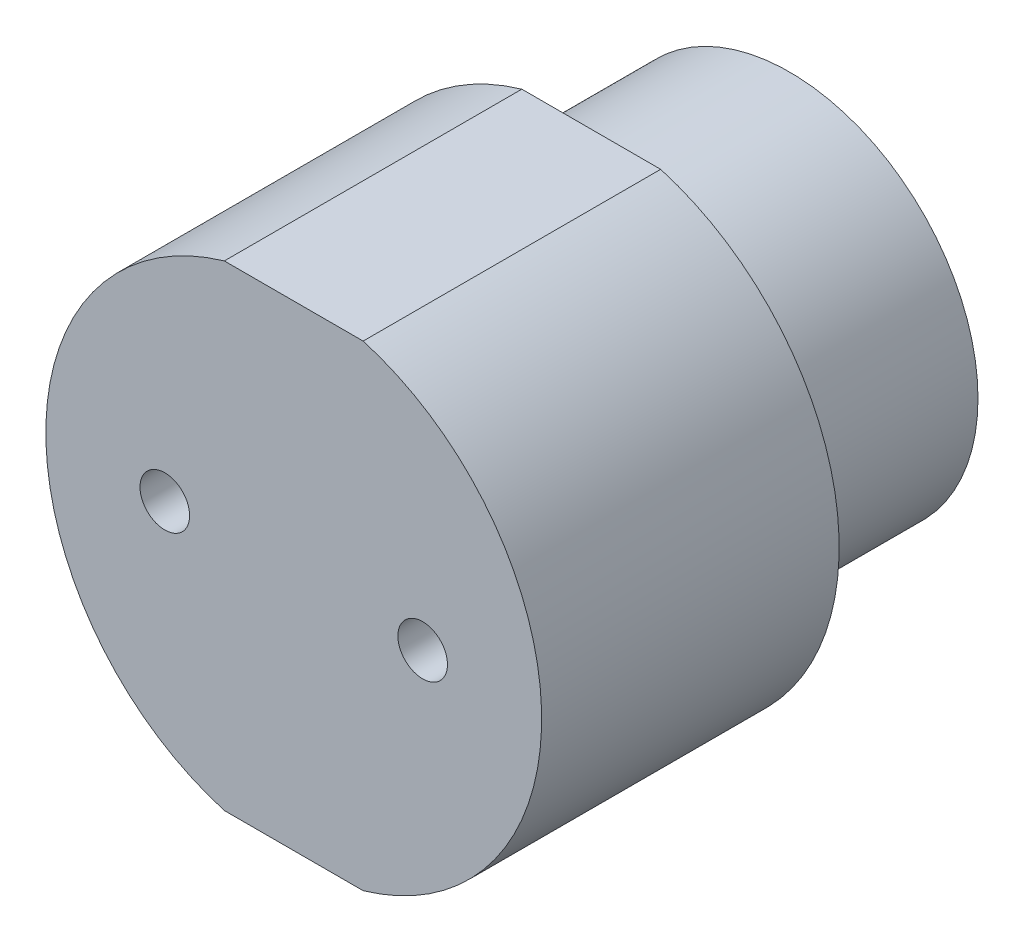
ISO-10303-21;
HEADER;
FILE_DESCRIPTION(('STEP AP214'),'2;1');
FILE_NAME('part.step','',(''),(''),'','','');
FILE_SCHEMA(('AUTOMOTIVE_DESIGN { 1 0 10303 214 1 1 1 1 }'));
ENDSEC;
DATA;
#1=APPLICATION_CONTEXT('core data for automotive mechanical design processes');
#2=APPLICATION_PROTOCOL_DEFINITION('international standard','automotive_design',2000,#1);
#3=PRODUCT_CONTEXT('',#1,'mechanical');
#4=PRODUCT('Part','Part','',(#3));
#5=PRODUCT_RELATED_PRODUCT_CATEGORY('part','',(#4));
#6=PRODUCT_DEFINITION_FORMATION('','',#4);
#7=PRODUCT_DEFINITION_CONTEXT('part definition',#1,'design');
#8=PRODUCT_DEFINITION('design','',#6,#7);
#9=PRODUCT_DEFINITION_SHAPE('','',#8);
#10=(LENGTH_UNIT() NAMED_UNIT(*) SI_UNIT(.MILLI.,.METRE.));
#11=(NAMED_UNIT(*) PLANE_ANGLE_UNIT() SI_UNIT($,.RADIAN.));
#12=(NAMED_UNIT(*) SI_UNIT($,.STERADIAN.) SOLID_ANGLE_UNIT());
#13=UNCERTAINTY_MEASURE_WITH_UNIT(LENGTH_MEASURE(1.E-05),#10,'distance_accuracy_value','');
#14=(GEOMETRIC_REPRESENTATION_CONTEXT(3) GLOBAL_UNCERTAINTY_ASSIGNED_CONTEXT((#13)) GLOBAL_UNIT_ASSIGNED_CONTEXT((#10,
#11,#12)) REPRESENTATION_CONTEXT('',''));
#15=CARTESIAN_POINT('',(0.,0.,0.));
#16=DIRECTION('',(0.,0.,1.));
#17=DIRECTION('',(1.,0.,0.));
#18=AXIS2_PLACEMENT_3D('',#15,#16,#17);
#19=CARTESIAN_POINT('',(0.,0.,0.));
#20=DIRECTION('',(0.,0.,1.));
#21=DIRECTION('',(1.,0.,0.));
#22=AXIS2_PLACEMENT_3D('',#19,#20,#21);
#23=CYLINDRICAL_SURFACE('',#22,63.5);
#24=DIRECTION('',(0.,0.,1.));
#25=VECTOR('',#24,1.);
#26=CARTESIAN_POINT('',(17.78,60.96,0.));
#27=LINE('',#26,#25);
#28=CARTESIAN_POINT('',(17.78,60.96,0.));
#29=VERTEX_POINT('',#28);
#30=CARTESIAN_POINT('',(17.78,60.96,-76.2));
#31=VERTEX_POINT('',#30);
#32=EDGE_CURVE('E69',#29,#31,#27,.F.);
#33=ORIENTED_EDGE('',*,*,#32,.F.);
#34=CARTESIAN_POINT('',(0.,0.,0.));
#35=DIRECTION('',(0.,0.,1.));
#36=DIRECTION('',(1.,0.,0.));
#37=AXIS2_PLACEMENT_3D('',#34,#35,#36);
#38=CIRCLE('',#37,63.5);
#39=CARTESIAN_POINT('',(17.78,-60.96,0.));
#40=VERTEX_POINT('',#39);
#41=EDGE_CURVE('E102',#40,#29,#38,.T.);
#42=ORIENTED_EDGE('',*,*,#41,.F.);
#43=DIRECTION('',(0.,0.,1.));
#44=VECTOR('',#43,1.);
#45=CARTESIAN_POINT('',(17.78,-60.96,0.));
#46=LINE('',#45,#44);
#47=CARTESIAN_POINT('',(17.78,-60.96,-76.2));
#48=VERTEX_POINT('',#47);
#49=EDGE_CURVE('E85',#48,#40,#46,.T.);
#50=ORIENTED_EDGE('',*,*,#49,.F.);
#51=CARTESIAN_POINT('',(0.,0.,-76.2));
#52=DIRECTION('',(0.,0.,1.));
#53=DIRECTION('',(1.,0.,0.));
#54=AXIS2_PLACEMENT_3D('',#51,#52,#53);
#55=CIRCLE('',#54,63.5);
#56=EDGE_CURVE('E114',#48,#31,#55,.T.);
#57=ORIENTED_EDGE('',*,*,#56,.T.);
#58=EDGE_LOOP('',(#33,#42,#50,#57));
#59=FACE_BOUND('',#58,.T.);
#60=ADVANCED_FACE('F45',(#59),#23,.T.);
#61=CARTESIAN_POINT('',(0.,0.,0.));
#62=DIRECTION('',(0.,0.,1.));
#63=DIRECTION('',(1.,0.,0.));
#64=AXIS2_PLACEMENT_3D('',#61,#62,#63);
#65=PLANE('',#64);
#66=DIRECTION('',(1.,0.,0.));
#67=VECTOR('',#66,1.);
#68=CARTESIAN_POINT('',(-21.59,60.96,0.));
#69=LINE('',#68,#67);
#70=CARTESIAN_POINT('',(-17.78,60.96,0.));
#71=VERTEX_POINT('',#70);
#72=EDGE_CURVE('E94',#71,#29,#69,.T.);
#73=ORIENTED_EDGE('',*,*,#72,.F.);
#74=CARTESIAN_POINT('',(-17.78,-60.96,0.));
#75=VERTEX_POINT('',#74);
#76=EDGE_CURVE('E104',#71,#75,#38,.T.);
#77=ORIENTED_EDGE('',*,*,#76,.T.);
#78=DIRECTION('',(-1.,0.,0.));
#79=VECTOR('',#78,1.);
#80=CARTESIAN_POINT('',(-21.59,-60.96,0.));
#81=LINE('',#80,#79);
#82=EDGE_CURVE('E88',#40,#75,#81,.T.);
#83=ORIENTED_EDGE('',*,*,#82,.F.);
#84=ORIENTED_EDGE('',*,*,#41,.T.);
#85=EDGE_LOOP('',(#73,#77,#83,#84));
#86=FACE_BOUND('',#85,.T.);
#87=CARTESIAN_POINT('',(-33.02,0.,0.));
#88=DIRECTION('',(0.,0.,1.));
#89=DIRECTION('',(1.,0.,0.));
#90=AXIS2_PLACEMENT_3D('',#87,#88,#89);
#91=CIRCLE('',#90,6.35);
#92=CARTESIAN_POINT('',(-26.67,0.,0.));
#93=VERTEX_POINT('',#92);
#94=EDGE_CURVE('E143',#93,#93,#91,.F.);
#95=ORIENTED_EDGE('',*,*,#94,.T.);
#96=EDGE_LOOP('',(#95));
#97=FACE_BOUND('',#96,.T.);
#98=CARTESIAN_POINT('',(33.02,0.,0.));
#99=DIRECTION('',(0.,0.,1.));
#100=DIRECTION('',(1.,0.,0.));
#101=AXIS2_PLACEMENT_3D('',#98,#99,#100);
#102=CIRCLE('',#101,6.35);
#103=CARTESIAN_POINT('',(39.37,0.,0.));
#104=VERTEX_POINT('',#103);
#105=EDGE_CURVE('E148',#104,#104,#102,.F.);
#106=ORIENTED_EDGE('',*,*,#105,.T.);
#107=EDGE_LOOP('',(#106));
#108=FACE_BOUND('',#107,.T.);
#109=ADVANCED_FACE('F100',(#86,#97,#108),#65,.T.);
#110=DIRECTION('',(0.,0.,1.));
#111=VECTOR('',#110,1.);
#112=CARTESIAN_POINT('',(-17.78,60.96,0.));
#113=LINE('',#112,#111);
#114=CARTESIAN_POINT('',(-17.78,60.96,-76.2));
#115=VERTEX_POINT('',#114);
#116=EDGE_CURVE('E348',#115,#71,#113,.T.);
#117=ORIENTED_EDGE('',*,*,#116,.F.);
#118=CARTESIAN_POINT('',(-17.78,-60.96,-76.2));
#119=VERTEX_POINT('',#118);
#120=EDGE_CURVE('E108',#115,#119,#55,.T.);
#121=ORIENTED_EDGE('',*,*,#120,.T.);
#122=DIRECTION('',(0.,0.,1.));
#123=VECTOR('',#122,1.);
#124=CARTESIAN_POINT('',(-17.78,-60.96,0.));
#125=LINE('',#124,#123);
#126=EDGE_CURVE('E62',#75,#119,#125,.F.);
#127=ORIENTED_EDGE('',*,*,#126,.F.);
#128=ORIENTED_EDGE('',*,*,#76,.F.);
#129=EDGE_LOOP('',(#117,#121,#127,#128));
#130=FACE_BOUND('',#129,.T.);
#131=ADVANCED_FACE('F182',(#130),#23,.T.);
#132=CARTESIAN_POINT('',(63.5,0.,-76.2));
#133=DIRECTION('',(0.,0.,-1.));
#134=DIRECTION('',(-1.,0.,0.));
#135=AXIS2_PLACEMENT_3D('',#132,#133,#134);
#136=PLANE('',#135);
#137=DIRECTION('',(-1.,0.,0.));
#138=VECTOR('',#137,1.);
#139=CARTESIAN_POINT('',(63.5,60.96,-76.2));
#140=LINE('',#139,#138);
#141=EDGE_CURVE('E12',#31,#115,#140,.T.);
#142=ORIENTED_EDGE('',*,*,#141,.F.);
#143=ORIENTED_EDGE('',*,*,#56,.F.);
#144=DIRECTION('',(1.,0.,0.));
#145=VECTOR('',#144,1.);
#146=CARTESIAN_POINT('',(63.5,-60.96,-76.2));
#147=LINE('',#146,#145);
#148=EDGE_CURVE('E55',#119,#48,#147,.T.);
#149=ORIENTED_EDGE('',*,*,#148,.F.);
#150=ORIENTED_EDGE('',*,*,#120,.F.);
#151=EDGE_LOOP('',(#142,#143,#149,#150));
#152=FACE_BOUND('',#151,.T.);
#153=CARTESIAN_POINT('',(0.,0.,-76.2));
#154=DIRECTION('',(0.,0.,-1.));
#155=DIRECTION('',(-1.,0.,0.));
#156=AXIS2_PLACEMENT_3D('',#153,#154,#155);
#157=CIRCLE('',#156,53.34);
#158=CARTESIAN_POINT('',(-53.34,0.,-76.2));
#159=VERTEX_POINT('',#158);
#160=EDGE_CURVE('E162',#159,#159,#157,.F.);
#161=ORIENTED_EDGE('',*,*,#160,.T.);
#162=EDGE_LOOP('',(#161));
#163=FACE_BOUND('',#162,.T.);
#164=ADVANCED_FACE('F180',(#152,#163),#136,.T.);
#165=CARTESIAN_POINT('',(0.,0.,0.));
#166=DIRECTION('',(0.,0.,1.));
#167=DIRECTION('',(1.,0.,0.));
#168=AXIS2_PLACEMENT_3D('',#165,#166,#167);
#169=CYLINDRICAL_SURFACE('',#168,48.26);
#170=CARTESIAN_POINT('',(0.,0.,-81.28));
#171=DIRECTION('',(0.,0.,-1.));
#172=DIRECTION('',(-1.,0.,0.));
#173=AXIS2_PLACEMENT_3D('',#170,#171,#172);
#174=CIRCLE('',#173,48.26);
#175=CARTESIAN_POINT('',(-48.26,0.,-81.28));
#176=VERTEX_POINT('',#175);
#177=EDGE_CURVE('E166',#176,#176,#174,.T.);
#178=ORIENTED_EDGE('',*,*,#177,.T.);
#179=EDGE_LOOP('',(#178));
#180=FACE_BOUND('',#179,.T.);
#181=CARTESIAN_POINT('',(0.,0.,-127.));
#182=DIRECTION('',(0.,0.,1.));
#183=DIRECTION('',(1.,0.,0.));
#184=AXIS2_PLACEMENT_3D('',#181,#182,#183);
#185=CIRCLE('',#184,48.26);
#186=CARTESIAN_POINT('',(48.26,0.,-127.));
#187=VERTEX_POINT('',#186);
#188=EDGE_CURVE('E298',#187,#187,#185,.T.);
#189=ORIENTED_EDGE('',*,*,#188,.T.);
#190=EDGE_LOOP('',(#189));
#191=FACE_BOUND('',#190,.T.);
#192=ADVANCED_FACE('F172',(#180,#191),#169,.T.);
#193=CARTESIAN_POINT('',(48.26,0.,-127.));
#194=DIRECTION('',(0.,0.,-1.));
#195=DIRECTION('',(-1.,0.,0.));
#196=AXIS2_PLACEMENT_3D('',#193,#194,#195);
#197=PLANE('',#196);
#198=CARTESIAN_POINT('',(0.,0.,-127.));
#199=DIRECTION('',(0.,0.,1.));
#200=DIRECTION('',(1.,0.,0.));
#201=AXIS2_PLACEMENT_3D('',#198,#199,#200);
#202=CIRCLE('',#201,35.56);
#203=CARTESIAN_POINT('',(35.56,0.,-127.));
#204=VERTEX_POINT('',#203);
#205=EDGE_CURVE('E295',#204,#204,#202,.T.);
#206=ORIENTED_EDGE('',*,*,#205,.T.);
#207=EDGE_LOOP('',(#206));
#208=FACE_BOUND('',#207,.T.);
#209=ORIENTED_EDGE('',*,*,#188,.F.);
#210=EDGE_LOOP('',(#209));
#211=FACE_BOUND('',#210,.T.);
#212=ADVANCED_FACE('F189',(#208,#211),#197,.T.);
#213=CARTESIAN_POINT('',(0.,0.,0.));
#214=DIRECTION('',(0.,0.,1.));
#215=DIRECTION('',(1.,0.,0.));
#216=AXIS2_PLACEMENT_3D('',#213,#214,#215);
#217=CYLINDRICAL_SURFACE('',#216,35.56);
#218=CARTESIAN_POINT('',(0.,0.,-119.38));
#219=DIRECTION('',(0.,0.,-1.));
#220=DIRECTION('',(-1.,0.,0.));
#221=AXIS2_PLACEMENT_3D('',#218,#219,#220);
#222=CIRCLE('',#221,35.56);
#223=CARTESIAN_POINT('',(-35.56,0.,-119.38));
#224=VERTEX_POINT('',#223);
#225=EDGE_CURVE('E158',#224,#224,#222,.F.);
#226=ORIENTED_EDGE('',*,*,#225,.T.);
#227=EDGE_LOOP('',(#226));
#228=FACE_BOUND('',#227,.T.);
#229=ORIENTED_EDGE('',*,*,#205,.F.);
#230=EDGE_LOOP('',(#229));
#231=FACE_BOUND('',#230,.T.);
#232=ADVANCED_FACE('F215',(#228,#231),#217,.F.);
#233=CARTESIAN_POINT('',(0.,0.,-114.3));
#234=DIRECTION('',(0.,0.,-1.));
#235=DIRECTION('',(-1.,0.,0.));
#236=AXIS2_PLACEMENT_3D('',#233,#234,#235);
#237=PLANE('',#236);
#238=CARTESIAN_POINT('',(0.,0.,-114.3));
#239=DIRECTION('',(0.,0.,-1.));
#240=DIRECTION('',(-1.,0.,0.));
#241=AXIS2_PLACEMENT_3D('',#238,#239,#240);
#242=CIRCLE('',#241,30.48);
#243=CARTESIAN_POINT('',(-30.48,0.,-114.3));
#244=VERTEX_POINT('',#243);
#245=EDGE_CURVE('E131',#244,#244,#242,.T.);
#246=ORIENTED_EDGE('',*,*,#245,.T.);
#247=EDGE_LOOP('',(#246));
#248=FACE_BOUND('',#247,.T.);
#249=CARTESIAN_POINT('',(15.24,0.,-114.3));
#250=DIRECTION('',(0.,0.,-1.));
#251=DIRECTION('',(-1.,0.,0.));
#252=AXIS2_PLACEMENT_3D('',#249,#250,#251);
#253=CIRCLE('',#252,6.35);
#254=CARTESIAN_POINT('',(8.89,0.,-114.3));
#255=VERTEX_POINT('',#254);
#256=EDGE_CURVE('E142',#255,#255,#253,.F.);
#257=ORIENTED_EDGE('',*,*,#256,.T.);
#258=EDGE_LOOP('',(#257));
#259=FACE_BOUND('',#258,.T.);
#260=CARTESIAN_POINT('',(-15.3213067163372,0.,-114.3));
#261=DIRECTION('',(0.,0.,-1.));
#262=DIRECTION('',(-1.,0.,0.));
#263=AXIS2_PLACEMENT_3D('',#260,#261,#262);
#264=CIRCLE('',#263,6.35);
#265=CARTESIAN_POINT('',(-21.6713067163372,0.,-114.3));
#266=VERTEX_POINT('',#265);
#267=EDGE_CURVE('E138',#266,#266,#264,.F.);
#268=ORIENTED_EDGE('',*,*,#267,.T.);
#269=EDGE_LOOP('',(#268));
#270=FACE_BOUND('',#269,.T.);
#271=ADVANCED_FACE('F211',(#248,#259,#270),#237,.T.);
#272=CARTESIAN_POINT('',(15.24,0.,-114.3));
#273=DIRECTION('',(0.,0.,1.));
#274=DIRECTION('',(1.,0.,0.));
#275=AXIS2_PLACEMENT_3D('',#272,#273,#274);
#276=CYLINDRICAL_SURFACE('',#275,6.35);
#277=CARTESIAN_POINT('',(15.24,0.,-50.8));
#278=DIRECTION('',(0.707106781186547,0.,0.707106781186547));
#279=DIRECTION('',(-0.707106781186548,0.,0.707106781186548));
#280=AXIS2_PLACEMENT_3D('',#277,#278,#279);
#281=ELLIPSE('',#280,8.98025612106915,6.35);
#282=CARTESIAN_POINT('',(8.89,0.,-44.45));
#283=VERTEX_POINT('',#282);
#284=EDGE_CURVE('E326',#283,#283,#281,.T.);
#285=ORIENTED_EDGE('',*,*,#284,.T.);
#286=EDGE_LOOP('',(#285));
#287=FACE_BOUND('',#286,.T.);
#288=ORIENTED_EDGE('',*,*,#256,.F.);
#289=EDGE_LOOP('',(#288));
#290=FACE_BOUND('',#289,.T.);
#291=ADVANCED_FACE('F214',(#287,#290),#276,.F.);
#292=CARTESIAN_POINT('',(8.155,0.,-50.8));
#293=DIRECTION('',(1.,0.,0.));
#294=DIRECTION('',(0.,0.,-1.));
#295=AXIS2_PLACEMENT_3D('',#292,#293,#294);
#296=CYLINDRICAL_SURFACE('',#295,6.35);
#297=ORIENTED_EDGE('',*,*,#284,.F.);
#298=EDGE_LOOP('',(#297));
#299=FACE_BOUND('',#298,.T.);
#300=CARTESIAN_POINT('',(33.02,0.,-50.8));
#301=DIRECTION('',(0.707106781186547,0.,0.707106781186548));
#302=DIRECTION('',(0.707106781186548,0.,-0.707106781186547));
#303=AXIS2_PLACEMENT_3D('',#300,#301,#302);
#304=ELLIPSE('',#303,8.98025612106916,6.35);
#305=CARTESIAN_POINT('',(39.37,0.,-57.15));
#306=VERTEX_POINT('',#305);
#307=EDGE_CURVE('E136',#306,#306,#304,.T.);
#308=ORIENTED_EDGE('',*,*,#307,.T.);
#309=EDGE_LOOP('',(#308));
#310=FACE_BOUND('',#309,.T.);
#311=ADVANCED_FACE('F232',(#299,#310),#296,.F.);
#312=CARTESIAN_POINT('',(33.02,0.,-57.885));
#313=DIRECTION('',(0.,0.,1.));
#314=DIRECTION('',(1.,0.,0.));
#315=AXIS2_PLACEMENT_3D('',#312,#313,#314);
#316=CYLINDRICAL_SURFACE('',#315,6.35);
#317=ORIENTED_EDGE('',*,*,#307,.F.);
#318=EDGE_LOOP('',(#317));
#319=FACE_BOUND('',#318,.T.);
#320=ORIENTED_EDGE('',*,*,#105,.F.);
#321=EDGE_LOOP('',(#320));
#322=FACE_BOUND('',#321,.T.);
#323=ADVANCED_FACE('F223',(#319,#322),#316,.F.);
#324=CARTESIAN_POINT('',(-15.3213067163372,0.,-43.715));
#325=DIRECTION('',(0.,0.,-1.));
#326=DIRECTION('',(-1.,0.,0.));
#327=AXIS2_PLACEMENT_3D('',#324,#325,#326);
#328=CYLINDRICAL_SURFACE('',#327,6.35);
#329=CARTESIAN_POINT('',(-15.3213067163372,0.,-50.8));
#330=DIRECTION('',(0.707106781186548,0.,-0.707106781186548));
#331=DIRECTION('',(0.707106781186548,0.,0.707106781186548));
#332=AXIS2_PLACEMENT_3D('',#329,#330,#331);
#333=ELLIPSE('',#332,8.98025612106916,6.35);
#334=CARTESIAN_POINT('',(-8.97130671633718,0.,-44.45));
#335=VERTEX_POINT('',#334);
#336=EDGE_CURVE('E147',#335,#335,#333,.F.);
#337=ORIENTED_EDGE('',*,*,#336,.T.);
#338=EDGE_LOOP('',(#337));
#339=FACE_BOUND('',#338,.T.);
#340=ORIENTED_EDGE('',*,*,#267,.F.);
#341=EDGE_LOOP('',(#340));
#342=FACE_BOUND('',#341,.T.);
#343=ADVANCED_FACE('F221',(#339,#342),#328,.F.);
#344=CARTESIAN_POINT('',(-40.105,0.,-50.8));
#345=DIRECTION('',(1.,0.,0.));
#346=DIRECTION('',(0.,0.,-1.));
#347=AXIS2_PLACEMENT_3D('',#344,#345,#346);
#348=CYLINDRICAL_SURFACE('',#347,6.35);
#349=CARTESIAN_POINT('',(-33.02,0.,-50.8));
#350=DIRECTION('',(0.707106781186548,0.,-0.707106781186548));
#351=DIRECTION('',(-0.707106781186548,0.,-0.707106781186548));
#352=AXIS2_PLACEMENT_3D('',#349,#350,#351);
#353=ELLIPSE('',#352,8.98025612106916,6.35);
#354=CARTESIAN_POINT('',(-39.37,0.,-57.15));
#355=VERTEX_POINT('',#354);
#356=EDGE_CURVE('E340',#355,#355,#353,.F.);
#357=ORIENTED_EDGE('',*,*,#356,.T.);
#358=EDGE_LOOP('',(#357));
#359=FACE_BOUND('',#358,.T.);
#360=ORIENTED_EDGE('',*,*,#336,.F.);
#361=EDGE_LOOP('',(#360));
#362=FACE_BOUND('',#361,.T.);
#363=ADVANCED_FACE('F204',(#359,#362),#348,.F.);
#364=CARTESIAN_POINT('',(-33.02,0.,0.));
#365=DIRECTION('',(0.,0.,-1.));
#366=DIRECTION('',(-1.,0.,0.));
#367=AXIS2_PLACEMENT_3D('',#364,#365,#366);
#368=CYLINDRICAL_SURFACE('',#367,6.35);
#369=ORIENTED_EDGE('',*,*,#356,.F.);
#370=EDGE_LOOP('',(#369));
#371=FACE_BOUND('',#370,.T.);
#372=ORIENTED_EDGE('',*,*,#94,.F.);
#373=EDGE_LOOP('',(#372));
#374=FACE_BOUND('',#373,.T.);
#375=ADVANCED_FACE('F199',(#371,#374),#368,.F.);
#376=CARTESIAN_POINT('',(0.,0.,-119.38));
#377=DIRECTION('',(0.,0.,-1.));
#378=DIRECTION('',(-1.,0.,0.));
#379=AXIS2_PLACEMENT_3D('',#376,#377,#378);
#380=TOROIDAL_SURFACE('',#379,30.48,5.08);
#381=ORIENTED_EDGE('',*,*,#225,.F.);
#382=EDGE_LOOP('',(#381));
#383=FACE_BOUND('',#382,.T.);
#384=ORIENTED_EDGE('',*,*,#245,.F.);
#385=EDGE_LOOP('',(#384));
#386=FACE_BOUND('',#385,.T.);
#387=ADVANCED_FACE('F177',(#383,#386),#380,.F.);
#388=CARTESIAN_POINT('',(0.,0.,-81.28));
#389=DIRECTION('',(0.,0.,-1.));
#390=DIRECTION('',(-1.,0.,0.));
#391=AXIS2_PLACEMENT_3D('',#388,#389,#390);
#392=TOROIDAL_SURFACE('',#391,53.34,5.08);
#393=ORIENTED_EDGE('',*,*,#177,.F.);
#394=EDGE_LOOP('',(#393));
#395=FACE_BOUND('',#394,.T.);
#396=ORIENTED_EDGE('',*,*,#160,.F.);
#397=EDGE_LOOP('',(#396));
#398=FACE_BOUND('',#397,.T.);
#399=ADVANCED_FACE('F47',(#395,#398),#392,.F.);
#400=CARTESIAN_POINT('',(-21.59,-60.96,-137.16));
#401=DIRECTION('',(0.,1.,0.));
#402=DIRECTION('',(0.,0.,1.));
#403=AXIS2_PLACEMENT_3D('',#400,#401,#402);
#404=PLANE('',#403);
#405=ORIENTED_EDGE('',*,*,#126,.T.);
#406=ORIENTED_EDGE('',*,*,#148,.T.);
#407=ORIENTED_EDGE('',*,*,#49,.T.);
#408=ORIENTED_EDGE('',*,*,#82,.T.);
#409=EDGE_LOOP('',(#405,#406,#407,#408));
#410=FACE_BOUND('',#409,.T.);
#411=ADVANCED_FACE('F87',(#410),#404,.F.);
#412=CARTESIAN_POINT('',(-21.59,60.96,-137.16));
#413=DIRECTION('',(0.,-1.,0.));
#414=DIRECTION('',(0.,0.,-1.));
#415=AXIS2_PLACEMENT_3D('',#412,#413,#414);
#416=PLANE('',#415);
#417=ORIENTED_EDGE('',*,*,#32,.T.);
#418=ORIENTED_EDGE('',*,*,#141,.T.);
#419=ORIENTED_EDGE('',*,*,#116,.T.);
#420=ORIENTED_EDGE('',*,*,#72,.T.);
#421=EDGE_LOOP('',(#417,#418,#419,#420));
#422=FACE_BOUND('',#421,.T.);
#423=ADVANCED_FACE('F354',(#422),#416,.F.);
#424=CLOSED_SHELL('',(#60,#109,#131,#164,#192,#212,#232,#271,#291,#311,#323,#343,#363,#375,#387,
#399,#411,#423));
#425=CARTESIAN_POINT('',(0.,0.,-106.68));
#426=DIRECTION('',(0.,0.,-1.));
#427=DIRECTION('',(-1.,0.,0.));
#428=AXIS2_PLACEMENT_3D('',#425,#426,#427);
#429=PLANE('',#428);
#430=CARTESIAN_POINT('',(-15.3213067163372,0.,-106.68));
#431=DIRECTION('',(0.,0.,-1.));
#432=DIRECTION('',(-1.,0.,0.));
#433=AXIS2_PLACEMENT_3D('',#430,#431,#432);
#434=CIRCLE('',#433,8.89);
#435=CARTESIAN_POINT('',(-24.2113067163372,0.,-106.68));
#436=VERTEX_POINT('',#435);
#437=EDGE_CURVE('E132',#436,#436,#434,.T.);
#438=ORIENTED_EDGE('',*,*,#437,.T.);
#439=EDGE_LOOP('',(#438));
#440=FACE_BOUND('',#439,.T.);
#441=CARTESIAN_POINT('',(15.24,0.,-106.68));
#442=DIRECTION('',(0.,0.,-1.));
#443=DIRECTION('',(-1.,0.,0.));
#444=AXIS2_PLACEMENT_3D('',#441,#442,#443);
#445=CIRCLE('',#444,8.89);
#446=CARTESIAN_POINT('',(6.35,0.,-106.68));
#447=VERTEX_POINT('',#446);
#448=EDGE_CURVE('E112',#447,#447,#445,.F.);
#449=ORIENTED_EDGE('',*,*,#448,.F.);
#450=EDGE_LOOP('',(#449));
#451=FACE_BOUND('',#450,.T.);
#452=CARTESIAN_POINT('',(0.,0.,-106.68));
#453=DIRECTION('',(0.,0.,-1.));
#454=DIRECTION('',(-1.,0.,0.));
#455=AXIS2_PLACEMENT_3D('',#452,#453,#454);
#456=CIRCLE('',#455,35.56);
#457=CARTESIAN_POINT('',(-35.56,0.,-106.68));
#458=VERTEX_POINT('',#457);
#459=EDGE_CURVE('E122',#458,#458,#456,.T.);
#460=ORIENTED_EDGE('',*,*,#459,.F.);
#461=EDGE_LOOP('',(#460));
#462=FACE_BOUND('',#461,.T.);
#463=ADVANCED_FACE('F269',(#440,#451,#462),#429,.F.);
#464=CARTESIAN_POINT('',(50.8,0.,-12.7));
#465=DIRECTION('',(0.,0.,-1.));
#466=DIRECTION('',(-1.,0.,0.));
#467=AXIS2_PLACEMENT_3D('',#464,#465,#466);
#468=PLANE('',#467);
#469=CARTESIAN_POINT('',(-33.02,0.,-12.7));
#470=DIRECTION('',(0.,0.,-1.));
#471=DIRECTION('',(-1.,0.,0.));
#472=AXIS2_PLACEMENT_3D('',#469,#470,#471);
#473=CIRCLE('',#472,8.89);
#474=CARTESIAN_POINT('',(-41.91,0.,-12.7));
#475=VERTEX_POINT('',#474);
#476=EDGE_CURVE('E127',#475,#475,#473,.T.);
#477=ORIENTED_EDGE('',*,*,#476,.F.);
#478=EDGE_LOOP('',(#477));
#479=FACE_BOUND('',#478,.T.);
#480=CARTESIAN_POINT('',(33.02,0.,-12.7));
#481=DIRECTION('',(0.,0.,-1.));
#482=DIRECTION('',(-1.,0.,0.));
#483=AXIS2_PLACEMENT_3D('',#480,#481,#482);
#484=CIRCLE('',#483,8.89);
#485=CARTESIAN_POINT('',(24.13,0.,-12.7));
#486=VERTEX_POINT('',#485);
#487=EDGE_CURVE('E118',#486,#486,#484,.F.);
#488=ORIENTED_EDGE('',*,*,#487,.T.);
#489=EDGE_LOOP('',(#488));
#490=FACE_BOUND('',#489,.T.);
#491=CARTESIAN_POINT('',(0.,0.,-12.7));
#492=DIRECTION('',(0.,0.,1.));
#493=DIRECTION('',(1.,0.,0.));
#494=AXIS2_PLACEMENT_3D('',#491,#492,#493);
#495=CIRCLE('',#494,50.8);
#496=CARTESIAN_POINT('',(50.8,0.,-12.7));
#497=VERTEX_POINT('',#496);
#498=EDGE_CURVE('E312',#497,#497,#495,.T.);
#499=ORIENTED_EDGE('',*,*,#498,.F.);
#500=EDGE_LOOP('',(#499));
#501=FACE_BOUND('',#500,.T.);
#502=ADVANCED_FACE('F271',(#479,#490,#501),#468,.T.);
#503=CARTESIAN_POINT('',(0.,0.,0.));
#504=DIRECTION('',(0.,0.,1.));
#505=DIRECTION('',(1.,0.,0.));
#506=AXIS2_PLACEMENT_3D('',#503,#504,#505);
#507=CYLINDRICAL_SURFACE('',#506,50.8);
#508=ORIENTED_EDGE('',*,*,#498,.T.);
#509=EDGE_LOOP('',(#508));
#510=FACE_BOUND('',#509,.T.);
#511=CARTESIAN_POINT('',(0.,0.,-63.5));
#512=DIRECTION('',(0.,0.,1.));
#513=DIRECTION('',(1.,0.,0.));
#514=AXIS2_PLACEMENT_3D('',#511,#512,#513);
#515=CIRCLE('',#514,50.8);
#516=CARTESIAN_POINT('',(50.8,0.,-63.5));
#517=VERTEX_POINT('',#516);
#518=EDGE_CURVE('E308',#517,#517,#515,.T.);
#519=ORIENTED_EDGE('',*,*,#518,.F.);
#520=EDGE_LOOP('',(#519));
#521=FACE_BOUND('',#520,.T.);
#522=ADVANCED_FACE('F276',(#510,#521),#507,.F.);
#523=CARTESIAN_POINT('',(35.56,0.,-63.5));
#524=DIRECTION('',(0.,0.,1.));
#525=DIRECTION('',(1.,0.,0.));
#526=AXIS2_PLACEMENT_3D('',#523,#524,#525);
#527=PLANE('',#526);
#528=ORIENTED_EDGE('',*,*,#518,.T.);
#529=EDGE_LOOP('',(#528));
#530=FACE_BOUND('',#529,.T.);
#531=CARTESIAN_POINT('',(0.,0.,-63.5));
#532=DIRECTION('',(0.,0.,1.));
#533=DIRECTION('',(1.,0.,0.));
#534=AXIS2_PLACEMENT_3D('',#531,#532,#533);
#535=CIRCLE('',#534,35.56);
#536=CARTESIAN_POINT('',(35.56,0.,-63.5));
#537=VERTEX_POINT('',#536);
#538=EDGE_CURVE('E302',#537,#537,#535,.T.);
#539=ORIENTED_EDGE('',*,*,#538,.F.);
#540=EDGE_LOOP('',(#539));
#541=FACE_BOUND('',#540,.T.);
#542=ADVANCED_FACE('F280',(#530,#541),#527,.T.);
#543=ORIENTED_EDGE('',*,*,#538,.T.);
#544=EDGE_LOOP('',(#543));
#545=FACE_BOUND('',#544,.T.);
#546=ORIENTED_EDGE('',*,*,#459,.T.);
#547=EDGE_LOOP('',(#546));
#548=FACE_BOUND('',#547,.T.);
#549=ADVANCED_FACE('F267',(#545,#548),#217,.F.);
#550=CARTESIAN_POINT('',(15.24,0.,-114.3));
#551=DIRECTION('',(0.,0.,1.));
#552=DIRECTION('',(1.,0.,0.));
#553=AXIS2_PLACEMENT_3D('',#550,#551,#552);
#554=CYLINDRICAL_SURFACE('',#553,8.89);
#555=CARTESIAN_POINT('',(15.24,0.,-50.8));
#556=DIRECTION('',(0.707106781186547,0.,0.707106781186547));
#557=DIRECTION('',(0.707106781186547,0.,-0.707106781186548));
#558=AXIS2_PLACEMENT_3D('',#555,#556,#557);
#559=ELLIPSE('',#558,12.5723585694968,8.89);
#560=CARTESIAN_POINT('',(24.13,0.,-59.69));
#561=VERTEX_POINT('',#560);
#562=EDGE_CURVE('E123',#561,#561,#559,.T.);
#563=ORIENTED_EDGE('',*,*,#562,.F.);
#564=EDGE_LOOP('',(#563));
#565=FACE_BOUND('',#564,.T.);
#566=ORIENTED_EDGE('',*,*,#448,.T.);
#567=EDGE_LOOP('',(#566));
#568=FACE_BOUND('',#567,.T.);
#569=ADVANCED_FACE('F260',(#565,#568),#554,.T.);
#570=CARTESIAN_POINT('',(33.02,0.,-57.885));
#571=DIRECTION('',(0.,0.,1.));
#572=DIRECTION('',(1.,0.,0.));
#573=AXIS2_PLACEMENT_3D('',#570,#571,#572);
#574=CYLINDRICAL_SURFACE('',#573,8.89);
#575=ORIENTED_EDGE('',*,*,#487,.F.);
#576=EDGE_LOOP('',(#575));
#577=FACE_BOUND('',#576,.T.);
#578=CARTESIAN_POINT('',(33.02,0.,-50.8));
#579=DIRECTION('',(0.707106781186547,0.,0.707106781186548));
#580=DIRECTION('',(-0.707106781186547,0.,0.707106781186547));
#581=AXIS2_PLACEMENT_3D('',#578,#579,#580);
#582=ELLIPSE('',#581,12.5723585694968,8.89);
#583=CARTESIAN_POINT('',(24.13,0.,-41.91));
#584=VERTEX_POINT('',#583);
#585=EDGE_CURVE('E322',#584,#584,#582,.T.);
#586=ORIENTED_EDGE('',*,*,#585,.T.);
#587=EDGE_LOOP('',(#586));
#588=FACE_BOUND('',#587,.T.);
#589=ADVANCED_FACE('F244',(#577,#588),#574,.T.);
#590=CARTESIAN_POINT('',(8.155,0.,-50.8));
#591=DIRECTION('',(1.,0.,0.));
#592=DIRECTION('',(0.,0.,-1.));
#593=AXIS2_PLACEMENT_3D('',#590,#591,#592);
#594=CYLINDRICAL_SURFACE('',#593,8.89);
#595=ORIENTED_EDGE('',*,*,#562,.T.);
#596=EDGE_LOOP('',(#595));
#597=FACE_BOUND('',#596,.T.);
#598=ORIENTED_EDGE('',*,*,#585,.F.);
#599=EDGE_LOOP('',(#598));
#600=FACE_BOUND('',#599,.T.);
#601=ADVANCED_FACE('F241',(#597,#600),#594,.T.);
#602=CARTESIAN_POINT('',(-15.3213067163372,0.,-43.715));
#603=DIRECTION('',(0.,0.,-1.));
#604=DIRECTION('',(-1.,0.,0.));
#605=AXIS2_PLACEMENT_3D('',#602,#603,#604);
#606=CYLINDRICAL_SURFACE('',#605,8.89);
#607=CARTESIAN_POINT('',(-15.3213067163372,0.,-50.8));
#608=DIRECTION('',(0.707106781186547,0.,-0.707106781186548));
#609=DIRECTION('',(0.707106781186547,0.,0.707106781186548));
#610=AXIS2_PLACEMENT_3D('',#607,#608,#609);
#611=ELLIPSE('',#610,12.5723585694968,8.89);
#612=CARTESIAN_POINT('',(-6.43130671633719,0.,-41.91));
#613=VERTEX_POINT('',#612);
#614=EDGE_CURVE('E336',#613,#613,#611,.F.);
#615=ORIENTED_EDGE('',*,*,#614,.F.);
#616=EDGE_LOOP('',(#615));
#617=FACE_BOUND('',#616,.T.);
#618=ORIENTED_EDGE('',*,*,#437,.F.);
#619=EDGE_LOOP('',(#618));
#620=FACE_BOUND('',#619,.T.);
#621=ADVANCED_FACE('F237',(#617,#620),#606,.T.);
#622=CARTESIAN_POINT('',(-40.105,0.,-50.8));
#623=DIRECTION('',(1.,0.,0.));
#624=DIRECTION('',(0.,0.,-1.));
#625=AXIS2_PLACEMENT_3D('',#622,#623,#624);
#626=CYLINDRICAL_SURFACE('',#625,8.89);
#627=CARTESIAN_POINT('',(-33.02,0.,-50.8));
#628=DIRECTION('',(0.707106781186547,0.,-0.707106781186548));
#629=DIRECTION('',(-0.707106781186547,0.,-0.707106781186548));
#630=AXIS2_PLACEMENT_3D('',#627,#628,#629);
#631=ELLIPSE('',#630,12.5723585694968,8.89);
#632=CARTESIAN_POINT('',(-41.91,0.,-59.69));
#633=VERTEX_POINT('',#632);
#634=EDGE_CURVE('E137',#633,#633,#631,.F.);
#635=ORIENTED_EDGE('',*,*,#634,.F.);
#636=EDGE_LOOP('',(#635));
#637=FACE_BOUND('',#636,.T.);
#638=ORIENTED_EDGE('',*,*,#614,.T.);
#639=EDGE_LOOP('',(#638));
#640=FACE_BOUND('',#639,.T.);
#641=ADVANCED_FACE('F240',(#637,#640),#626,.T.);
#642=CARTESIAN_POINT('',(-33.02,0.,0.));
#643=DIRECTION('',(0.,0.,-1.));
#644=DIRECTION('',(-1.,0.,0.));
#645=AXIS2_PLACEMENT_3D('',#642,#643,#644);
#646=CYLINDRICAL_SURFACE('',#645,8.89);
#647=ORIENTED_EDGE('',*,*,#476,.T.);
#648=EDGE_LOOP('',(#647));
#649=FACE_BOUND('',#648,.T.);
#650=ORIENTED_EDGE('',*,*,#634,.T.);
#651=EDGE_LOOP('',(#650));
#652=FACE_BOUND('',#651,.T.);
#653=ADVANCED_FACE('F243',(#649,#652),#646,.T.);
#654=CLOSED_SHELL('',(#463,#502,#522,#542,#549,#569,#589,#601,#621,#641,#653));
#655=ORIENTED_CLOSED_SHELL('',*,#654,.T.);
#656=BREP_WITH_VOIDS('B2',#424,(#655));
#657=ADVANCED_BREP_SHAPE_REPRESENTATION('',(#18,#656),#14);
#658=SHAPE_DEFINITION_REPRESENTATION(#9,#657);
ENDSEC;
END-ISO-10303-21;
